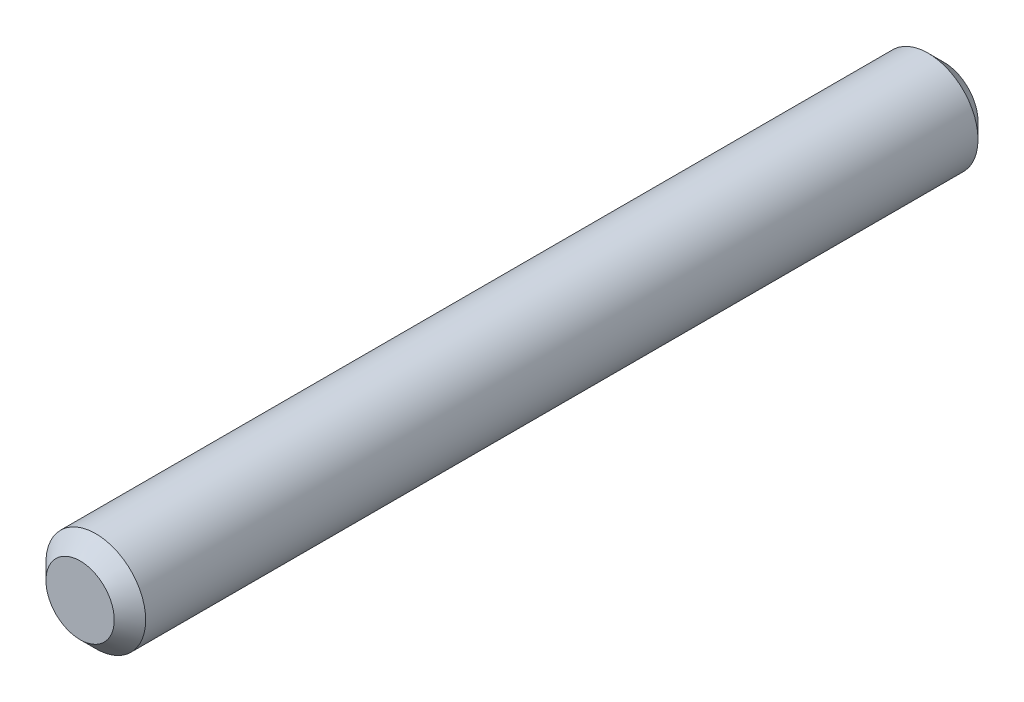
ISO-10303-21;
HEADER;
FILE_DESCRIPTION(('STEP AP214'),'2;1');
FILE_NAME('part.step','',(''),(''),'','','');
FILE_SCHEMA(('AUTOMOTIVE_DESIGN { 1 0 10303 214 1 1 1 1 }'));
ENDSEC;
DATA;
#1=APPLICATION_CONTEXT('core data for automotive mechanical design processes');
#2=APPLICATION_PROTOCOL_DEFINITION('international standard','automotive_design',2000,#1);
#3=PRODUCT_CONTEXT('',#1,'mechanical');
#4=PRODUCT('Part','Part','',(#3));
#5=PRODUCT_RELATED_PRODUCT_CATEGORY('part','',(#4));
#6=PRODUCT_DEFINITION_FORMATION('','',#4);
#7=PRODUCT_DEFINITION_CONTEXT('part definition',#1,'design');
#8=PRODUCT_DEFINITION('design','',#6,#7);
#9=PRODUCT_DEFINITION_SHAPE('','',#8);
#10=(LENGTH_UNIT() NAMED_UNIT(*) SI_UNIT(.MILLI.,.METRE.));
#11=(NAMED_UNIT(*) PLANE_ANGLE_UNIT() SI_UNIT($,.RADIAN.));
#12=(NAMED_UNIT(*) SI_UNIT($,.STERADIAN.) SOLID_ANGLE_UNIT());
#13=UNCERTAINTY_MEASURE_WITH_UNIT(LENGTH_MEASURE(1.E-05),#10,'distance_accuracy_value','');
#14=(GEOMETRIC_REPRESENTATION_CONTEXT(3) GLOBAL_UNCERTAINTY_ASSIGNED_CONTEXT((#13)) GLOBAL_UNIT_ASSIGNED_CONTEXT((#10,
#11,#12)) REPRESENTATION_CONTEXT('',''));
#15=CARTESIAN_POINT('',(0.,0.,0.));
#16=DIRECTION('',(0.,0.,1.));
#17=DIRECTION('',(1.,0.,0.));
#18=AXIS2_PLACEMENT_3D('',#15,#16,#17);
#19=CARTESIAN_POINT('',(0.,0.,-54.9999999999999));
#20=DIRECTION('',(0.,0.,0.999999999999999));
#21=DIRECTION('',(1.,0.,0.));
#22=AXIS2_PLACEMENT_3D('',#19,#20,#21);
#23=CYLINDRICAL_SURFACE('',#22,3.175);
#24=CARTESIAN_POINT('',(0.,0.,-53.9999999999999));
#25=DIRECTION('',(0.,0.,0.999999999999999));
#26=DIRECTION('',(1.,0.,0.));
#27=AXIS2_PLACEMENT_3D('',#24,#25,#26);
#28=CIRCLE('',#27,3.175);
#29=CARTESIAN_POINT('',(3.175,0.,-53.9999999999999));
#30=VERTEX_POINT('',#29);
#31=EDGE_CURVE('E49',#30,#30,#28,.T.);
#32=ORIENTED_EDGE('',*,*,#31,.T.);
#33=EDGE_LOOP('',(#32));
#34=FACE_BOUND('',#33,.T.);
#35=CARTESIAN_POINT('',(0.,0.,-1.));
#36=DIRECTION('',(0.,0.,0.999999999999999));
#37=DIRECTION('',(1.,0.,0.));
#38=AXIS2_PLACEMENT_3D('',#35,#36,#37);
#39=CIRCLE('',#38,3.175);
#40=CARTESIAN_POINT('',(3.175,0.,-1.));
#41=VERTEX_POINT('',#40);
#42=EDGE_CURVE('E53',#41,#41,#39,.F.);
#43=ORIENTED_EDGE('',*,*,#42,.T.);
#44=EDGE_LOOP('',(#43));
#45=FACE_BOUND('',#44,.T.);
#46=ADVANCED_FACE('F38',(#34,#45),#23,.T.);
#47=CARTESIAN_POINT('',(0.,0.,-54.9999999999999));
#48=DIRECTION('',(0.,0.,0.999999999999999));
#49=DIRECTION('',(1.,0.,0.));
#50=AXIS2_PLACEMENT_3D('',#47,#48,#49);
#51=PLANE('',#50);
#52=CARTESIAN_POINT('',(0.,0.,-54.9999999999999));
#53=DIRECTION('',(0.,0.,0.999999999999999));
#54=DIRECTION('',(1.,0.,0.));
#55=AXIS2_PLACEMENT_3D('',#52,#53,#54);
#56=CIRCLE('',#55,2.17499999999998);
#57=CARTESIAN_POINT('',(2.17499999999998,0.,-54.9999999999999));
#58=VERTEX_POINT('',#57);
#59=EDGE_CURVE('E45',#58,#58,#56,.F.);
#60=ORIENTED_EDGE('',*,*,#59,.T.);
#61=EDGE_LOOP('',(#60));
#62=FACE_BOUND('',#61,.T.);
#63=ADVANCED_FACE('F69',(#62),#51,.F.);
#64=CARTESIAN_POINT('',(0.,0.,0.));
#65=DIRECTION('',(0.,0.,0.999999999999999));
#66=DIRECTION('',(1.,0.,0.));
#67=AXIS2_PLACEMENT_3D('',#64,#65,#66);
#68=PLANE('',#67);
#69=CARTESIAN_POINT('',(0.,0.,0.));
#70=DIRECTION('',(0.,0.,0.999999999999999));
#71=DIRECTION('',(1.,0.,0.));
#72=AXIS2_PLACEMENT_3D('',#69,#70,#71);
#73=CIRCLE('',#72,2.175);
#74=CARTESIAN_POINT('',(2.175,0.,0.));
#75=VERTEX_POINT('',#74);
#76=EDGE_CURVE('E10',#75,#75,#73,.T.);
#77=ORIENTED_EDGE('',*,*,#76,.T.);
#78=EDGE_LOOP('',(#77));
#79=FACE_BOUND('',#78,.T.);
#80=ADVANCED_FACE('F66',(#79),#68,.T.);
#81=CARTESIAN_POINT('',(0.,0.,-53.9999999999999));
#82=DIRECTION('',(0.,0.,0.999999999999999));
#83=DIRECTION('',(1.,0.,0.));
#84=AXIS2_PLACEMENT_3D('',#81,#82,#83);
#85=CONICAL_SURFACE('',#84,3.175,0.78539816339745);
#86=ORIENTED_EDGE('',*,*,#59,.F.);
#87=EDGE_LOOP('',(#86));
#88=FACE_BOUND('',#87,.T.);
#89=ORIENTED_EDGE('',*,*,#31,.F.);
#90=EDGE_LOOP('',(#89));
#91=FACE_BOUND('',#90,.T.);
#92=ADVANCED_FACE('F62',(#88,#91),#85,.T.);
#93=CARTESIAN_POINT('',(0.,0.,0.));
#94=DIRECTION('',(0.,0.,-0.999999999999999));
#95=DIRECTION('',(-1.,0.,0.));
#96=AXIS2_PLACEMENT_3D('',#93,#94,#95);
#97=CONICAL_SURFACE('',#96,2.175,0.785398163397446);
#98=ORIENTED_EDGE('',*,*,#42,.F.);
#99=EDGE_LOOP('',(#98));
#100=FACE_BOUND('',#99,.T.);
#101=ORIENTED_EDGE('',*,*,#76,.F.);
#102=EDGE_LOOP('',(#101));
#103=FACE_BOUND('',#102,.T.);
#104=ADVANCED_FACE('F40',(#100,#103),#97,.T.);
#105=CLOSED_SHELL('',(#46,#63,#80,#92,#104));
#106=MANIFOLD_SOLID_BREP('B2',#105);
#107=ADVANCED_BREP_SHAPE_REPRESENTATION('',(#18,#106),#14);
#108=SHAPE_DEFINITION_REPRESENTATION(#9,#107);
ENDSEC;
END-ISO-10303-21;
